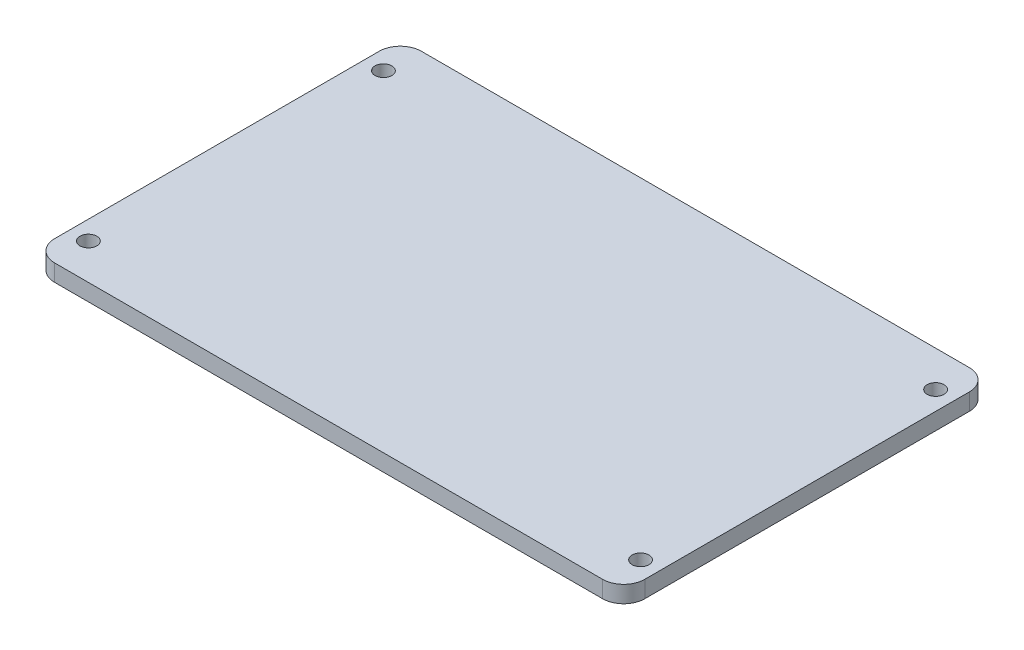
ISO-10303-21;
HEADER;
FILE_DESCRIPTION(('STEP AP214'),'2;1');
FILE_NAME('part.step','',(''),(''),'','','');
FILE_SCHEMA(('AUTOMOTIVE_DESIGN { 1 0 10303 214 1 1 1 1 }'));
ENDSEC;
DATA;
#1=APPLICATION_CONTEXT('core data for automotive mechanical design processes');
#2=APPLICATION_PROTOCOL_DEFINITION('international standard','automotive_design',2000,#1);
#3=PRODUCT_CONTEXT('',#1,'mechanical');
#4=PRODUCT('Part','Part','',(#3));
#5=PRODUCT_RELATED_PRODUCT_CATEGORY('part','',(#4));
#6=PRODUCT_DEFINITION_FORMATION('','',#4);
#7=PRODUCT_DEFINITION_CONTEXT('part definition',#1,'design');
#8=PRODUCT_DEFINITION('design','',#6,#7);
#9=PRODUCT_DEFINITION_SHAPE('','',#8);
#10=(LENGTH_UNIT() NAMED_UNIT(*) SI_UNIT(.MILLI.,.METRE.));
#11=(NAMED_UNIT(*) PLANE_ANGLE_UNIT() SI_UNIT($,.RADIAN.));
#12=(NAMED_UNIT(*) SI_UNIT($,.STERADIAN.) SOLID_ANGLE_UNIT());
#13=UNCERTAINTY_MEASURE_WITH_UNIT(LENGTH_MEASURE(1.E-05),#10,'distance_accuracy_value','');
#14=(GEOMETRIC_REPRESENTATION_CONTEXT(3) GLOBAL_UNCERTAINTY_ASSIGNED_CONTEXT((#13)) GLOBAL_UNIT_ASSIGNED_CONTEXT((#10,
#11,#12)) REPRESENTATION_CONTEXT('',''));
#15=CARTESIAN_POINT('',(0.,0.,0.));
#16=DIRECTION('',(0.,0.,1.));
#17=DIRECTION('',(1.,0.,0.));
#18=AXIS2_PLACEMENT_3D('',#15,#16,#17);
#19=CARTESIAN_POINT('',(70.,4.,-43.5));
#20=DIRECTION('',(-1.,0.,0.));
#21=DIRECTION('',(0.,0.,1.));
#22=AXIS2_PLACEMENT_3D('',#19,#20,#21);
#23=PLANE('',#22);
#24=DIRECTION('',(0.,0.,-1.));
#25=VECTOR('',#24,1.);
#26=CARTESIAN_POINT('',(70.,0.,-43.5));
#27=LINE('',#26,#25);
#28=CARTESIAN_POINT('',(70.,0.,38.5));
#29=VERTEX_POINT('',#28);
#30=CARTESIAN_POINT('',(70.,0.,-38.5));
#31=VERTEX_POINT('',#30);
#32=EDGE_CURVE('E126',#29,#31,#27,.T.);
#33=ORIENTED_EDGE('',*,*,#32,.T.);
#34=DIRECTION('',(0.,-1.,0.));
#35=VECTOR('',#34,1.);
#36=CARTESIAN_POINT('',(70.,4.,-38.5));
#37=LINE('',#36,#35);
#38=CARTESIAN_POINT('',(70.,4.,-38.5));
#39=VERTEX_POINT('',#38);
#40=EDGE_CURVE('E104',#31,#39,#37,.F.);
#41=ORIENTED_EDGE('',*,*,#40,.T.);
#42=DIRECTION('',(0.,0.,-1.));
#43=VECTOR('',#42,1.);
#44=CARTESIAN_POINT('',(70.,4.,-43.5));
#45=LINE('',#44,#43);
#46=CARTESIAN_POINT('',(70.,4.,38.5));
#47=VERTEX_POINT('',#46);
#48=EDGE_CURVE('E136',#47,#39,#45,.T.);
#49=ORIENTED_EDGE('',*,*,#48,.F.);
#50=DIRECTION('',(0.,-1.,0.));
#51=VECTOR('',#50,1.);
#52=CARTESIAN_POINT('',(70.,4.,38.5));
#53=LINE('',#52,#51);
#54=EDGE_CURVE('E109',#47,#29,#53,.T.);
#55=ORIENTED_EDGE('',*,*,#54,.T.);
#56=EDGE_LOOP('',(#33,#41,#49,#55));
#57=FACE_BOUND('',#56,.T.);
#58=ADVANCED_FACE('F33',(#57),#23,.F.);
#59=CARTESIAN_POINT('',(-70.,4.,-43.5));
#60=DIRECTION('',(0.,0.,1.));
#61=DIRECTION('',(1.,0.,0.));
#62=AXIS2_PLACEMENT_3D('',#59,#60,#61);
#63=PLANE('',#62);
#64=DIRECTION('',(-1.,0.,0.));
#65=VECTOR('',#64,1.);
#66=CARTESIAN_POINT('',(-70.,4.,-43.5));
#67=LINE('',#66,#65);
#68=CARTESIAN_POINT('',(65.,4.,-43.5));
#69=VERTEX_POINT('',#68);
#70=CARTESIAN_POINT('',(-65.,4.,-43.5));
#71=VERTEX_POINT('',#70);
#72=EDGE_CURVE('E119',#69,#71,#67,.T.);
#73=ORIENTED_EDGE('',*,*,#72,.F.);
#74=DIRECTION('',(0.,-1.,0.));
#75=VECTOR('',#74,1.);
#76=CARTESIAN_POINT('',(65.,4.,-43.5));
#77=LINE('',#76,#75);
#78=CARTESIAN_POINT('',(65.,0.,-43.5));
#79=VERTEX_POINT('',#78);
#80=EDGE_CURVE('E103',#69,#79,#77,.T.);
#81=ORIENTED_EDGE('',*,*,#80,.T.);
#82=DIRECTION('',(-1.,0.,0.));
#83=VECTOR('',#82,1.);
#84=CARTESIAN_POINT('',(-70.,0.,-43.5));
#85=LINE('',#84,#83);
#86=CARTESIAN_POINT('',(-65.,0.,-43.5));
#87=VERTEX_POINT('',#86);
#88=EDGE_CURVE('E116',#79,#87,#85,.T.);
#89=ORIENTED_EDGE('',*,*,#88,.T.);
#90=DIRECTION('',(0.,-1.,0.));
#91=VECTOR('',#90,1.);
#92=CARTESIAN_POINT('',(-65.,4.,-43.5));
#93=LINE('',#92,#91);
#94=EDGE_CURVE('E121',#87,#71,#93,.F.);
#95=ORIENTED_EDGE('',*,*,#94,.T.);
#96=EDGE_LOOP('',(#73,#81,#89,#95));
#97=FACE_BOUND('',#96,.T.);
#98=ADVANCED_FACE('F115',(#97),#63,.F.);
#99=CARTESIAN_POINT('',(-70.,4.,-43.5));
#100=DIRECTION('',(1.,0.,0.));
#101=DIRECTION('',(0.,0.,-1.));
#102=AXIS2_PLACEMENT_3D('',#99,#100,#101);
#103=PLANE('',#102);
#104=DIRECTION('',(0.,0.,1.));
#105=VECTOR('',#104,1.);
#106=CARTESIAN_POINT('',(-70.,0.,-43.5));
#107=LINE('',#106,#105);
#108=CARTESIAN_POINT('',(-70.,0.,-38.5));
#109=VERTEX_POINT('',#108);
#110=CARTESIAN_POINT('',(-70.,0.,38.5));
#111=VERTEX_POINT('',#110);
#112=EDGE_CURVE('E125',#109,#111,#107,.T.);
#113=ORIENTED_EDGE('',*,*,#112,.T.);
#114=DIRECTION('',(0.,-1.,0.));
#115=VECTOR('',#114,1.);
#116=CARTESIAN_POINT('',(-70.,4.,38.5));
#117=LINE('',#116,#115);
#118=CARTESIAN_POINT('',(-70.,4.,38.5));
#119=VERTEX_POINT('',#118);
#120=EDGE_CURVE('E11',#111,#119,#117,.F.);
#121=ORIENTED_EDGE('',*,*,#120,.T.);
#122=DIRECTION('',(0.,0.,1.));
#123=VECTOR('',#122,1.);
#124=CARTESIAN_POINT('',(-70.,4.,-43.5));
#125=LINE('',#124,#123);
#126=CARTESIAN_POINT('',(-70.,4.,-38.5));
#127=VERTEX_POINT('',#126);
#128=EDGE_CURVE('E174',#127,#119,#125,.T.);
#129=ORIENTED_EDGE('',*,*,#128,.F.);
#130=DIRECTION('',(0.,-1.,0.));
#131=VECTOR('',#130,1.);
#132=CARTESIAN_POINT('',(-70.,4.,-38.5));
#133=LINE('',#132,#131);
#134=EDGE_CURVE('E41',#127,#109,#133,.T.);
#135=ORIENTED_EDGE('',*,*,#134,.T.);
#136=EDGE_LOOP('',(#113,#121,#129,#135));
#137=FACE_BOUND('',#136,.T.);
#138=ADVANCED_FACE('F172',(#137),#103,.F.);
#139=CARTESIAN_POINT('',(-70.,4.,43.5));
#140=DIRECTION('',(0.,0.,-1.));
#141=DIRECTION('',(-1.,0.,0.));
#142=AXIS2_PLACEMENT_3D('',#139,#140,#141);
#143=PLANE('',#142);
#144=DIRECTION('',(1.,0.,0.));
#145=VECTOR('',#144,1.);
#146=CARTESIAN_POINT('',(-70.,0.,43.5));
#147=LINE('',#146,#145);
#148=CARTESIAN_POINT('',(-65.,0.,43.5));
#149=VERTEX_POINT('',#148);
#150=CARTESIAN_POINT('',(65.,0.,43.5));
#151=VERTEX_POINT('',#150);
#152=EDGE_CURVE('E129',#149,#151,#147,.T.);
#153=ORIENTED_EDGE('',*,*,#152,.T.);
#154=DIRECTION('',(0.,-1.,0.));
#155=VECTOR('',#154,1.);
#156=CARTESIAN_POINT('',(65.,4.,43.5));
#157=LINE('',#156,#155);
#158=CARTESIAN_POINT('',(65.,4.,43.5));
#159=VERTEX_POINT('',#158);
#160=EDGE_CURVE('E48',#151,#159,#157,.F.);
#161=ORIENTED_EDGE('',*,*,#160,.T.);
#162=DIRECTION('',(1.,0.,0.));
#163=VECTOR('',#162,1.);
#164=CARTESIAN_POINT('',(-70.,4.,43.5));
#165=LINE('',#164,#163);
#166=CARTESIAN_POINT('',(-65.,4.,43.5));
#167=VERTEX_POINT('',#166);
#168=EDGE_CURVE('E149',#167,#159,#165,.T.);
#169=ORIENTED_EDGE('',*,*,#168,.F.);
#170=DIRECTION('',(0.,-1.,0.));
#171=VECTOR('',#170,1.);
#172=CARTESIAN_POINT('',(-65.,4.,43.5));
#173=LINE('',#172,#171);
#174=EDGE_CURVE('E165',#167,#149,#173,.T.);
#175=ORIENTED_EDGE('',*,*,#174,.T.);
#176=EDGE_LOOP('',(#153,#161,#169,#175));
#177=FACE_BOUND('',#176,.T.);
#178=ADVANCED_FACE('F181',(#177),#143,.F.);
#179=CARTESIAN_POINT('',(0.,4.,0.));
#180=DIRECTION('',(0.,1.,0.));
#181=DIRECTION('',(0.,0.,1.));
#182=AXIS2_PLACEMENT_3D('',#179,#180,#181);
#183=PLANE('',#182);
#184=CARTESIAN_POINT('',(65.5,4.,-35.));
#185=DIRECTION('',(0.,1.,0.));
#186=DIRECTION('',(0.,0.,1.));
#187=AXIS2_PLACEMENT_3D('',#184,#185,#186);
#188=CIRCLE('',#187,2.);
#189=CARTESIAN_POINT('',(65.5,4.,-33.));
#190=VERTEX_POINT('',#189);
#191=EDGE_CURVE('E190',#190,#190,#188,.T.);
#192=ORIENTED_EDGE('',*,*,#191,.F.);
#193=EDGE_LOOP('',(#192));
#194=FACE_BOUND('',#193,.T.);
#195=CARTESIAN_POINT('',(-65.5,4.,35.));
#196=DIRECTION('',(0.,1.,0.));
#197=DIRECTION('',(0.,0.,1.));
#198=AXIS2_PLACEMENT_3D('',#195,#196,#197);
#199=CIRCLE('',#198,2.);
#200=CARTESIAN_POINT('',(-65.5,4.,37.));
#201=VERTEX_POINT('',#200);
#202=EDGE_CURVE('E191',#201,#201,#199,.T.);
#203=ORIENTED_EDGE('',*,*,#202,.F.);
#204=EDGE_LOOP('',(#203));
#205=FACE_BOUND('',#204,.T.);
#206=CARTESIAN_POINT('',(65.5,4.,35.));
#207=DIRECTION('',(0.,1.,0.));
#208=DIRECTION('',(0.,0.,1.));
#209=AXIS2_PLACEMENT_3D('',#206,#207,#208);
#210=CIRCLE('',#209,2.);
#211=CARTESIAN_POINT('',(65.5,4.,37.));
#212=VERTEX_POINT('',#211);
#213=EDGE_CURVE('E194',#212,#212,#210,.T.);
#214=ORIENTED_EDGE('',*,*,#213,.F.);
#215=EDGE_LOOP('',(#214));
#216=FACE_BOUND('',#215,.T.);
#217=CARTESIAN_POINT('',(-65.5,4.,-35.));
#218=DIRECTION('',(0.,1.,0.));
#219=DIRECTION('',(0.,0.,1.));
#220=AXIS2_PLACEMENT_3D('',#217,#218,#219);
#221=CIRCLE('',#220,2.);
#222=CARTESIAN_POINT('',(-65.5,4.,-33.));
#223=VERTEX_POINT('',#222);
#224=EDGE_CURVE('E141',#223,#223,#221,.T.);
#225=ORIENTED_EDGE('',*,*,#224,.F.);
#226=EDGE_LOOP('',(#225));
#227=FACE_BOUND('',#226,.T.);
#228=ORIENTED_EDGE('',*,*,#48,.T.);
#229=CARTESIAN_POINT('',(65.,4.,-38.5));
#230=DIRECTION('',(0.,1.,0.));
#231=DIRECTION('',(0.,0.,1.));
#232=AXIS2_PLACEMENT_3D('',#229,#230,#231);
#233=CIRCLE('',#232,5.);
#234=EDGE_CURVE('E163',#39,#69,#233,.T.);
#235=ORIENTED_EDGE('',*,*,#234,.T.);
#236=ORIENTED_EDGE('',*,*,#72,.T.);
#237=CARTESIAN_POINT('',(-65.,4.,-38.5));
#238=DIRECTION('',(0.,1.,0.));
#239=DIRECTION('',(0.,0.,1.));
#240=AXIS2_PLACEMENT_3D('',#237,#238,#239);
#241=CIRCLE('',#240,5.);
#242=EDGE_CURVE('E158',#71,#127,#241,.T.);
#243=ORIENTED_EDGE('',*,*,#242,.T.);
#244=ORIENTED_EDGE('',*,*,#128,.T.);
#245=CARTESIAN_POINT('',(-65.,4.,38.5));
#246=DIRECTION('',(0.,1.,0.));
#247=DIRECTION('',(0.,0.,1.));
#248=AXIS2_PLACEMENT_3D('',#245,#246,#247);
#249=CIRCLE('',#248,5.);
#250=EDGE_CURVE('E55',#119,#167,#249,.T.);
#251=ORIENTED_EDGE('',*,*,#250,.T.);
#252=ORIENTED_EDGE('',*,*,#168,.T.);
#253=CARTESIAN_POINT('',(65.,4.,38.5));
#254=DIRECTION('',(0.,1.,0.));
#255=DIRECTION('',(0.,0.,1.));
#256=AXIS2_PLACEMENT_3D('',#253,#254,#255);
#257=CIRCLE('',#256,5.);
#258=EDGE_CURVE('E161',#159,#47,#257,.T.);
#259=ORIENTED_EDGE('',*,*,#258,.T.);
#260=EDGE_LOOP('',(#228,#235,#236,#243,#244,#251,#252,#259));
#261=FACE_BOUND('',#260,.T.);
#262=ADVANCED_FACE('F203',(#194,#205,#216,#227,#261),#183,.T.);
#263=CARTESIAN_POINT('',(0.,0.,0.));
#264=DIRECTION('',(0.,1.,0.));
#265=DIRECTION('',(0.,0.,1.));
#266=AXIS2_PLACEMENT_3D('',#263,#264,#265);
#267=PLANE('',#266);
#268=CARTESIAN_POINT('',(65.5,0.,-35.));
#269=DIRECTION('',(0.,1.,0.));
#270=DIRECTION('',(0.,0.,1.));
#271=AXIS2_PLACEMENT_3D('',#268,#269,#270);
#272=CIRCLE('',#271,2.);
#273=CARTESIAN_POINT('',(65.5,0.,-33.));
#274=VERTEX_POINT('',#273);
#275=EDGE_CURVE('E131',#274,#274,#272,.T.);
#276=ORIENTED_EDGE('',*,*,#275,.T.);
#277=EDGE_LOOP('',(#276));
#278=FACE_BOUND('',#277,.T.);
#279=CARTESIAN_POINT('',(-65.5,0.,35.));
#280=DIRECTION('',(0.,1.,0.));
#281=DIRECTION('',(0.,0.,1.));
#282=AXIS2_PLACEMENT_3D('',#279,#280,#281);
#283=CIRCLE('',#282,2.);
#284=CARTESIAN_POINT('',(-65.5,0.,37.));
#285=VERTEX_POINT('',#284);
#286=EDGE_CURVE('E144',#285,#285,#283,.T.);
#287=ORIENTED_EDGE('',*,*,#286,.T.);
#288=EDGE_LOOP('',(#287));
#289=FACE_BOUND('',#288,.T.);
#290=CARTESIAN_POINT('',(65.5,0.,35.));
#291=DIRECTION('',(0.,1.,0.));
#292=DIRECTION('',(0.,0.,1.));
#293=AXIS2_PLACEMENT_3D('',#290,#291,#292);
#294=CIRCLE('',#293,2.);
#295=CARTESIAN_POINT('',(65.5,0.,37.));
#296=VERTEX_POINT('',#295);
#297=EDGE_CURVE('E140',#296,#296,#294,.T.);
#298=ORIENTED_EDGE('',*,*,#297,.T.);
#299=EDGE_LOOP('',(#298));
#300=FACE_BOUND('',#299,.T.);
#301=CARTESIAN_POINT('',(-65.5,0.,-35.));
#302=DIRECTION('',(0.,1.,0.));
#303=DIRECTION('',(0.,0.,1.));
#304=AXIS2_PLACEMENT_3D('',#301,#302,#303);
#305=CIRCLE('',#304,2.);
#306=CARTESIAN_POINT('',(-65.5,0.,-33.));
#307=VERTEX_POINT('',#306);
#308=EDGE_CURVE('E137',#307,#307,#305,.T.);
#309=ORIENTED_EDGE('',*,*,#308,.T.);
#310=EDGE_LOOP('',(#309));
#311=FACE_BOUND('',#310,.T.);
#312=ORIENTED_EDGE('',*,*,#88,.F.);
#313=CARTESIAN_POINT('',(65.,0.,-38.5));
#314=DIRECTION('',(0.,1.,0.));
#315=DIRECTION('',(0.,0.,1.));
#316=AXIS2_PLACEMENT_3D('',#313,#314,#315);
#317=CIRCLE('',#316,5.);
#318=EDGE_CURVE('E99',#79,#31,#317,.F.);
#319=ORIENTED_EDGE('',*,*,#318,.T.);
#320=ORIENTED_EDGE('',*,*,#32,.F.);
#321=CARTESIAN_POINT('',(65.,0.,38.5));
#322=DIRECTION('',(0.,1.,0.));
#323=DIRECTION('',(0.,0.,1.));
#324=AXIS2_PLACEMENT_3D('',#321,#322,#323);
#325=CIRCLE('',#324,5.);
#326=EDGE_CURVE('E110',#29,#151,#325,.F.);
#327=ORIENTED_EDGE('',*,*,#326,.T.);
#328=ORIENTED_EDGE('',*,*,#152,.F.);
#329=CARTESIAN_POINT('',(-65.,0.,38.5));
#330=DIRECTION('',(0.,1.,0.));
#331=DIRECTION('',(0.,0.,1.));
#332=AXIS2_PLACEMENT_3D('',#329,#330,#331);
#333=CIRCLE('',#332,5.);
#334=EDGE_CURVE('E152',#149,#111,#333,.F.);
#335=ORIENTED_EDGE('',*,*,#334,.T.);
#336=ORIENTED_EDGE('',*,*,#112,.F.);
#337=CARTESIAN_POINT('',(-65.,0.,-38.5));
#338=DIRECTION('',(0.,1.,0.));
#339=DIRECTION('',(0.,0.,1.));
#340=AXIS2_PLACEMENT_3D('',#337,#338,#339);
#341=CIRCLE('',#340,5.);
#342=EDGE_CURVE('E120',#109,#87,#341,.F.);
#343=ORIENTED_EDGE('',*,*,#342,.T.);
#344=EDGE_LOOP('',(#312,#319,#320,#327,#328,#335,#336,#343));
#345=FACE_BOUND('',#344,.T.);
#346=ADVANCED_FACE('F123',(#278,#289,#300,#311,#345),#267,.F.);
#347=CARTESIAN_POINT('',(-65.5,-34.4951941520273,-35.));
#348=DIRECTION('',(0.,1.,0.));
#349=DIRECTION('',(0.,0.,1.));
#350=AXIS2_PLACEMENT_3D('',#347,#348,#349);
#351=CYLINDRICAL_SURFACE('',#350,2.);
#352=ORIENTED_EDGE('',*,*,#224,.T.);
#353=EDGE_LOOP('',(#352));
#354=FACE_BOUND('',#353,.T.);
#355=ORIENTED_EDGE('',*,*,#308,.F.);
#356=EDGE_LOOP('',(#355));
#357=FACE_BOUND('',#356,.T.);
#358=ADVANCED_FACE('F235',(#354,#357),#351,.F.);
#359=CARTESIAN_POINT('',(65.5,-34.4951941520273,35.));
#360=DIRECTION('',(0.,1.,0.));
#361=DIRECTION('',(0.,0.,1.));
#362=AXIS2_PLACEMENT_3D('',#359,#360,#361);
#363=CYLINDRICAL_SURFACE('',#362,2.);
#364=ORIENTED_EDGE('',*,*,#213,.T.);
#365=EDGE_LOOP('',(#364));
#366=FACE_BOUND('',#365,.T.);
#367=ORIENTED_EDGE('',*,*,#297,.F.);
#368=EDGE_LOOP('',(#367));
#369=FACE_BOUND('',#368,.T.);
#370=ADVANCED_FACE('F200',(#366,#369),#363,.F.);
#371=CARTESIAN_POINT('',(-65.5,-34.4951941520273,35.));
#372=DIRECTION('',(0.,1.,0.));
#373=DIRECTION('',(0.,0.,1.));
#374=AXIS2_PLACEMENT_3D('',#371,#372,#373);
#375=CYLINDRICAL_SURFACE('',#374,2.);
#376=ORIENTED_EDGE('',*,*,#202,.T.);
#377=EDGE_LOOP('',(#376));
#378=FACE_BOUND('',#377,.T.);
#379=ORIENTED_EDGE('',*,*,#286,.F.);
#380=EDGE_LOOP('',(#379));
#381=FACE_BOUND('',#380,.T.);
#382=ADVANCED_FACE('F241',(#378,#381),#375,.F.);
#383=CARTESIAN_POINT('',(65.5,-34.4951941520273,-35.));
#384=DIRECTION('',(0.,1.,0.));
#385=DIRECTION('',(0.,0.,1.));
#386=AXIS2_PLACEMENT_3D('',#383,#384,#385);
#387=CYLINDRICAL_SURFACE('',#386,2.);
#388=ORIENTED_EDGE('',*,*,#191,.T.);
#389=EDGE_LOOP('',(#388));
#390=FACE_BOUND('',#389,.T.);
#391=ORIENTED_EDGE('',*,*,#275,.F.);
#392=EDGE_LOOP('',(#391));
#393=FACE_BOUND('',#392,.T.);
#394=ADVANCED_FACE('F220',(#390,#393),#387,.F.);
#395=CARTESIAN_POINT('',(65.,4.,-38.5));
#396=DIRECTION('',(0.,-1.,0.));
#397=DIRECTION('',(0.,0.,-1.));
#398=AXIS2_PLACEMENT_3D('',#395,#396,#397);
#399=CYLINDRICAL_SURFACE('',#398,5.);
#400=ORIENTED_EDGE('',*,*,#234,.F.);
#401=ORIENTED_EDGE('',*,*,#40,.F.);
#402=ORIENTED_EDGE('',*,*,#318,.F.);
#403=ORIENTED_EDGE('',*,*,#80,.F.);
#404=EDGE_LOOP('',(#400,#401,#402,#403));
#405=FACE_BOUND('',#404,.T.);
#406=ADVANCED_FACE('F102',(#405),#399,.T.);
#407=CARTESIAN_POINT('',(65.,4.,38.5));
#408=DIRECTION('',(0.,-1.,0.));
#409=DIRECTION('',(0.,0.,-1.));
#410=AXIS2_PLACEMENT_3D('',#407,#408,#409);
#411=CYLINDRICAL_SURFACE('',#410,5.);
#412=ORIENTED_EDGE('',*,*,#258,.F.);
#413=ORIENTED_EDGE('',*,*,#160,.F.);
#414=ORIENTED_EDGE('',*,*,#326,.F.);
#415=ORIENTED_EDGE('',*,*,#54,.F.);
#416=EDGE_LOOP('',(#412,#413,#414,#415));
#417=FACE_BOUND('',#416,.T.);
#418=ADVANCED_FACE('F213',(#417),#411,.T.);
#419=CARTESIAN_POINT('',(-65.,4.,38.5));
#420=DIRECTION('',(0.,-1.,0.));
#421=DIRECTION('',(0.,0.,-1.));
#422=AXIS2_PLACEMENT_3D('',#419,#420,#421);
#423=CYLINDRICAL_SURFACE('',#422,5.);
#424=ORIENTED_EDGE('',*,*,#250,.F.);
#425=ORIENTED_EDGE('',*,*,#120,.F.);
#426=ORIENTED_EDGE('',*,*,#334,.F.);
#427=ORIENTED_EDGE('',*,*,#174,.F.);
#428=EDGE_LOOP('',(#424,#425,#426,#427));
#429=FACE_BOUND('',#428,.T.);
#430=ADVANCED_FACE('F180',(#429),#423,.T.);
#431=CARTESIAN_POINT('',(-65.,4.,-38.5));
#432=DIRECTION('',(0.,-1.,0.));
#433=DIRECTION('',(0.,0.,-1.));
#434=AXIS2_PLACEMENT_3D('',#431,#432,#433);
#435=CYLINDRICAL_SURFACE('',#434,5.);
#436=ORIENTED_EDGE('',*,*,#242,.F.);
#437=ORIENTED_EDGE('',*,*,#94,.F.);
#438=ORIENTED_EDGE('',*,*,#342,.F.);
#439=ORIENTED_EDGE('',*,*,#134,.F.);
#440=EDGE_LOOP('',(#436,#437,#438,#439));
#441=FACE_BOUND('',#440,.T.);
#442=ADVANCED_FACE('F35',(#441),#435,.T.);
#443=CLOSED_SHELL('',(#58,#98,#138,#178,#262,#346,#358,#370,#382,#394,#406,#418,#430,#442));
#444=MANIFOLD_SOLID_BREP('B2',#443);
#445=ADVANCED_BREP_SHAPE_REPRESENTATION('',(#18,#444),#14);
#446=SHAPE_DEFINITION_REPRESENTATION(#9,#445);
ENDSEC;
END-ISO-10303-21;
